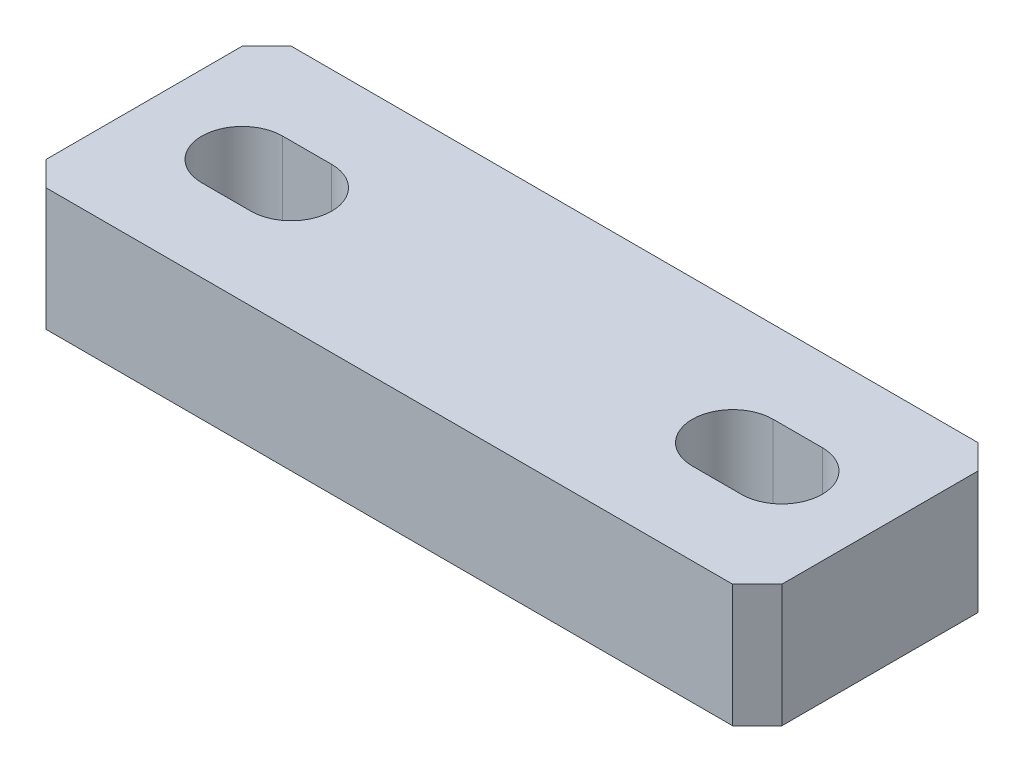
ISO-10303-21;
HEADER;
FILE_DESCRIPTION(('STEP AP214'),'2;1');
FILE_NAME('part.step','',(''),(''),'','','');
FILE_SCHEMA(('AUTOMOTIVE_DESIGN { 1 0 10303 214 1 1 1 1 }'));
ENDSEC;
DATA;
#1=APPLICATION_CONTEXT('core data for automotive mechanical design processes');
#2=APPLICATION_PROTOCOL_DEFINITION('international standard','automotive_design',2000,#1);
#3=PRODUCT_CONTEXT('',#1,'mechanical');
#4=PRODUCT('Part','Part','',(#3));
#5=PRODUCT_RELATED_PRODUCT_CATEGORY('part','',(#4));
#6=PRODUCT_DEFINITION_FORMATION('','',#4);
#7=PRODUCT_DEFINITION_CONTEXT('part definition',#1,'design');
#8=PRODUCT_DEFINITION('design','',#6,#7);
#9=PRODUCT_DEFINITION_SHAPE('','',#8);
#10=(LENGTH_UNIT() NAMED_UNIT(*) SI_UNIT(.MILLI.,.METRE.));
#11=(NAMED_UNIT(*) PLANE_ANGLE_UNIT() SI_UNIT($,.RADIAN.));
#12=(NAMED_UNIT(*) SI_UNIT($,.STERADIAN.) SOLID_ANGLE_UNIT());
#13=UNCERTAINTY_MEASURE_WITH_UNIT(LENGTH_MEASURE(1.E-05),#10,'distance_accuracy_value','');
#14=(GEOMETRIC_REPRESENTATION_CONTEXT(3) GLOBAL_UNCERTAINTY_ASSIGNED_CONTEXT((#13)) GLOBAL_UNIT_ASSIGNED_CONTEXT((#10,
#11,#12)) REPRESENTATION_CONTEXT('',''));
#15=CARTESIAN_POINT('',(0.,0.,0.));
#16=DIRECTION('',(0.,0.,1.));
#17=DIRECTION('',(1.,0.,0.));
#18=AXIS2_PLACEMENT_3D('',#15,#16,#17);
#19=CARTESIAN_POINT('',(-15.,5.,10.));
#20=DIRECTION('',(1.,0.,0.));
#21=DIRECTION('',(0.,0.,-1.));
#22=AXIS2_PLACEMENT_3D('',#19,#20,#21);
#23=PLANE('',#22);
#24=DIRECTION('',(0.,0.,-1.));
#25=VECTOR('',#24,1.);
#26=CARTESIAN_POINT('',(-15.,5.,10.));
#27=LINE('',#26,#25);
#28=CARTESIAN_POINT('',(-15.,5.,9.));
#29=VERTEX_POINT('',#28);
#30=CARTESIAN_POINT('',(-15.,5.,0.999999999999995));
#31=VERTEX_POINT('',#30);
#32=EDGE_CURVE('E228',#29,#31,#27,.T.);
#33=ORIENTED_EDGE('',*,*,#32,.T.);
#34=DIRECTION('',(0.,-1.,0.));
#35=VECTOR('',#34,1.);
#36=CARTESIAN_POINT('',(-15.,5.,0.999999999999994));
#37=LINE('',#36,#35);
#38=CARTESIAN_POINT('',(-15.,0.,0.999999999999995));
#39=VERTEX_POINT('',#38);
#40=EDGE_CURVE('E11',#31,#39,#37,.T.);
#41=ORIENTED_EDGE('',*,*,#40,.T.);
#42=DIRECTION('',(0.,0.,-1.));
#43=VECTOR('',#42,1.);
#44=CARTESIAN_POINT('',(-15.,0.,10.));
#45=LINE('',#44,#43);
#46=CARTESIAN_POINT('',(-15.,0.,9.));
#47=VERTEX_POINT('',#46);
#48=EDGE_CURVE('E240',#47,#39,#45,.T.);
#49=ORIENTED_EDGE('',*,*,#48,.F.);
#50=DIRECTION('',(0.,1.,0.));
#51=VECTOR('',#50,1.);
#52=CARTESIAN_POINT('',(-15.,5.,9.));
#53=LINE('',#52,#51);
#54=EDGE_CURVE('E247',#47,#29,#53,.T.);
#55=ORIENTED_EDGE('',*,*,#54,.T.);
#56=EDGE_LOOP('',(#33,#41,#49,#55));
#57=FACE_BOUND('',#56,.T.);
#58=ADVANCED_FACE('F32',(#57),#23,.F.);
#59=CARTESIAN_POINT('',(-15.,0.,10.));
#60=DIRECTION('',(0.,1.,0.));
#61=DIRECTION('',(0.,0.,1.));
#62=AXIS2_PLACEMENT_3D('',#59,#60,#61);
#63=PLANE('',#62);
#64=DIRECTION('',(1.,0.,0.));
#65=VECTOR('',#64,1.);
#66=CARTESIAN_POINT('',(-15.,0.,6.65));
#67=LINE('',#66,#65);
#68=CARTESIAN_POINT('',(9.,0.,6.65));
#69=VERTEX_POINT('',#68);
#70=CARTESIAN_POINT('',(11.,0.,6.65));
#71=VERTEX_POINT('',#70);
#72=EDGE_CURVE('E183',#69,#71,#67,.T.);
#73=ORIENTED_EDGE('',*,*,#72,.T.);
#74=CARTESIAN_POINT('',(11.,0.,5.));
#75=DIRECTION('',(0.,1.,0.));
#76=DIRECTION('',(0.,0.,1.));
#77=AXIS2_PLACEMENT_3D('',#74,#75,#76);
#78=CIRCLE('',#77,1.65);
#79=CARTESIAN_POINT('',(11.,0.,3.35));
#80=VERTEX_POINT('',#79);
#81=EDGE_CURVE('E186',#71,#80,#78,.T.);
#82=ORIENTED_EDGE('',*,*,#81,.T.);
#83=DIRECTION('',(-1.,0.,0.));
#84=VECTOR('',#83,1.);
#85=CARTESIAN_POINT('',(-15.,0.,3.35));
#86=LINE('',#85,#84);
#87=CARTESIAN_POINT('',(9.,0.,3.35));
#88=VERTEX_POINT('',#87);
#89=EDGE_CURVE('E178',#80,#88,#86,.T.);
#90=ORIENTED_EDGE('',*,*,#89,.T.);
#91=CARTESIAN_POINT('',(9.,0.,5.));
#92=DIRECTION('',(0.,1.,0.));
#93=DIRECTION('',(0.,0.,1.));
#94=AXIS2_PLACEMENT_3D('',#91,#92,#93);
#95=CIRCLE('',#94,1.65);
#96=EDGE_CURVE('E153',#88,#69,#95,.T.);
#97=ORIENTED_EDGE('',*,*,#96,.T.);
#98=EDGE_LOOP('',(#73,#82,#90,#97));
#99=FACE_BOUND('',#98,.T.);
#100=DIRECTION('',(-1.,0.,0.));
#101=VECTOR('',#100,1.);
#102=CARTESIAN_POINT('',(-15.,0.,3.35));
#103=LINE('',#102,#101);
#104=CARTESIAN_POINT('',(-9.,0.,3.35));
#105=VERTEX_POINT('',#104);
#106=CARTESIAN_POINT('',(-11.,0.,3.35));
#107=VERTEX_POINT('',#106);
#108=EDGE_CURVE('E215',#105,#107,#103,.T.);
#109=ORIENTED_EDGE('',*,*,#108,.T.);
#110=CARTESIAN_POINT('',(-11.,0.,5.));
#111=DIRECTION('',(0.,1.,0.));
#112=DIRECTION('',(0.,0.,1.));
#113=AXIS2_PLACEMENT_3D('',#110,#111,#112);
#114=CIRCLE('',#113,1.65);
#115=CARTESIAN_POINT('',(-11.,0.,6.65));
#116=VERTEX_POINT('',#115);
#117=EDGE_CURVE('E218',#107,#116,#114,.T.);
#118=ORIENTED_EDGE('',*,*,#117,.T.);
#119=DIRECTION('',(1.,0.,0.));
#120=VECTOR('',#119,1.);
#121=CARTESIAN_POINT('',(-15.,0.,6.65));
#122=LINE('',#121,#120);
#123=CARTESIAN_POINT('',(-9.,0.,6.65));
#124=VERTEX_POINT('',#123);
#125=EDGE_CURVE('E203',#116,#124,#122,.T.);
#126=ORIENTED_EDGE('',*,*,#125,.T.);
#127=CARTESIAN_POINT('',(-9.,0.,5.));
#128=DIRECTION('',(0.,1.,0.));
#129=DIRECTION('',(0.,0.,1.));
#130=AXIS2_PLACEMENT_3D('',#127,#128,#129);
#131=CIRCLE('',#130,1.65);
#132=EDGE_CURVE('E212',#124,#105,#131,.T.);
#133=ORIENTED_EDGE('',*,*,#132,.T.);
#134=EDGE_LOOP('',(#109,#118,#126,#133));
#135=FACE_BOUND('',#134,.T.);
#136=DIRECTION('',(0.,0.,-1.));
#137=VECTOR('',#136,1.);
#138=CARTESIAN_POINT('',(15.,0.,10.));
#139=LINE('',#138,#137);
#140=CARTESIAN_POINT('',(15.,0.,9.));
#141=VERTEX_POINT('',#140);
#142=CARTESIAN_POINT('',(15.,0.,0.999999999999995));
#143=VERTEX_POINT('',#142);
#144=EDGE_CURVE('E237',#141,#143,#139,.T.);
#145=ORIENTED_EDGE('',*,*,#144,.F.);
#146=DIRECTION('',(-0.707106781186546,0.,0.707106781186549));
#147=VECTOR('',#146,1.);
#148=CARTESIAN_POINT('',(14.,0.,10.));
#149=LINE('',#148,#147);
#150=CARTESIAN_POINT('',(14.,0.,10.));
#151=VERTEX_POINT('',#150);
#152=EDGE_CURVE('E269',#141,#151,#149,.T.);
#153=ORIENTED_EDGE('',*,*,#152,.T.);
#154=DIRECTION('',(1.,0.,0.));
#155=VECTOR('',#154,1.);
#156=CARTESIAN_POINT('',(-15.,0.,10.));
#157=LINE('',#156,#155);
#158=CARTESIAN_POINT('',(-14.,0.,10.));
#159=VERTEX_POINT('',#158);
#160=EDGE_CURVE('E222',#159,#151,#157,.T.);
#161=ORIENTED_EDGE('',*,*,#160,.F.);
#162=DIRECTION('',(-0.707106781186546,0.,-0.707106781186549));
#163=VECTOR('',#162,1.);
#164=CARTESIAN_POINT('',(-14.,0.,10.));
#165=LINE('',#164,#163);
#166=EDGE_CURVE('E245',#159,#47,#165,.T.);
#167=ORIENTED_EDGE('',*,*,#166,.T.);
#168=ORIENTED_EDGE('',*,*,#48,.T.);
#169=DIRECTION('',(-0.707106781186549,0.,0.707106781186546));
#170=VECTOR('',#169,1.);
#171=CARTESIAN_POINT('',(-15.,0.,0.999999999999994));
#172=LINE('',#171,#170);
#173=CARTESIAN_POINT('',(-14.,0.,0.));
#174=VERTEX_POINT('',#173);
#175=EDGE_CURVE('E53',#39,#174,#172,.F.);
#176=ORIENTED_EDGE('',*,*,#175,.T.);
#177=DIRECTION('',(1.,0.,0.));
#178=VECTOR('',#177,1.);
#179=CARTESIAN_POINT('',(-15.,0.,0.));
#180=LINE('',#179,#178);
#181=CARTESIAN_POINT('',(14.,0.,0.));
#182=VERTEX_POINT('',#181);
#183=EDGE_CURVE('E221',#174,#182,#180,.T.);
#184=ORIENTED_EDGE('',*,*,#183,.T.);
#185=DIRECTION('',(-0.707106781186549,0.,-0.707106781186546));
#186=VECTOR('',#185,1.);
#187=CARTESIAN_POINT('',(15.,0.,0.999999999999994));
#188=LINE('',#187,#186);
#189=EDGE_CURVE('E267',#182,#143,#188,.F.);
#190=ORIENTED_EDGE('',*,*,#189,.T.);
#191=EDGE_LOOP('',(#145,#153,#161,#167,#168,#176,#184,#190));
#192=FACE_BOUND('',#191,.T.);
#193=ADVANCED_FACE('F284',(#99,#135,#192),#63,.F.);
#194=CARTESIAN_POINT('',(15.,0.,10.));
#195=DIRECTION('',(-1.,0.,0.));
#196=DIRECTION('',(0.,0.,1.));
#197=AXIS2_PLACEMENT_3D('',#194,#195,#196);
#198=PLANE('',#197);
#199=DIRECTION('',(0.,0.,-1.));
#200=VECTOR('',#199,1.);
#201=CARTESIAN_POINT('',(15.,5.,10.));
#202=LINE('',#201,#200);
#203=CARTESIAN_POINT('',(15.,5.,9.));
#204=VERTEX_POINT('',#203);
#205=CARTESIAN_POINT('',(15.,5.,0.999999999999995));
#206=VERTEX_POINT('',#205);
#207=EDGE_CURVE('E234',#204,#206,#202,.T.);
#208=ORIENTED_EDGE('',*,*,#207,.F.);
#209=DIRECTION('',(0.,-1.,0.));
#210=VECTOR('',#209,1.);
#211=CARTESIAN_POINT('',(15.,0.,9.));
#212=LINE('',#211,#210);
#213=EDGE_CURVE('E264',#204,#141,#212,.T.);
#214=ORIENTED_EDGE('',*,*,#213,.T.);
#215=ORIENTED_EDGE('',*,*,#144,.T.);
#216=DIRECTION('',(0.,1.,0.));
#217=VECTOR('',#216,1.);
#218=CARTESIAN_POINT('',(15.,0.,0.999999999999994));
#219=LINE('',#218,#217);
#220=EDGE_CURVE('E261',#143,#206,#219,.T.);
#221=ORIENTED_EDGE('',*,*,#220,.T.);
#222=EDGE_LOOP('',(#208,#214,#215,#221));
#223=FACE_BOUND('',#222,.T.);
#224=ADVANCED_FACE('F297',(#223),#198,.F.);
#225=CARTESIAN_POINT('',(15.,5.,10.));
#226=DIRECTION('',(0.,-1.,0.));
#227=DIRECTION('',(1.,0.,0.));
#228=AXIS2_PLACEMENT_3D('',#225,#226,#227);
#229=PLANE('',#228);
#230=DIRECTION('',(-1.,0.,0.));
#231=VECTOR('',#230,1.);
#232=CARTESIAN_POINT('',(11.,5.,3.35));
#233=LINE('',#232,#231);
#234=CARTESIAN_POINT('',(11.,5.,3.35));
#235=VERTEX_POINT('',#234);
#236=CARTESIAN_POINT('',(9.,5.,3.35));
#237=VERTEX_POINT('',#236);
#238=EDGE_CURVE('E161',#235,#237,#233,.T.);
#239=ORIENTED_EDGE('',*,*,#238,.F.);
#240=CARTESIAN_POINT('',(11.,5.,5.));
#241=DIRECTION('',(0.,1.,0.));
#242=DIRECTION('',(1.,0.,0.));
#243=AXIS2_PLACEMENT_3D('',#240,#241,#242);
#244=CIRCLE('',#243,1.65);
#245=CARTESIAN_POINT('',(11.,5.,6.65));
#246=VERTEX_POINT('',#245);
#247=EDGE_CURVE('E166',#246,#235,#244,.T.);
#248=ORIENTED_EDGE('',*,*,#247,.F.);
#249=DIRECTION('',(1.,0.,0.));
#250=VECTOR('',#249,1.);
#251=CARTESIAN_POINT('',(11.,5.,6.65));
#252=LINE('',#251,#250);
#253=CARTESIAN_POINT('',(9.,5.,6.65));
#254=VERTEX_POINT('',#253);
#255=EDGE_CURVE('E171',#254,#246,#252,.T.);
#256=ORIENTED_EDGE('',*,*,#255,.F.);
#257=CARTESIAN_POINT('',(9.,5.,5.));
#258=DIRECTION('',(0.,1.,0.));
#259=DIRECTION('',(1.,0.,0.));
#260=AXIS2_PLACEMENT_3D('',#257,#258,#259);
#261=CIRCLE('',#260,1.65);
#262=EDGE_CURVE('E150',#237,#254,#261,.T.);
#263=ORIENTED_EDGE('',*,*,#262,.F.);
#264=EDGE_LOOP('',(#239,#248,#256,#263));
#265=FACE_BOUND('',#264,.T.);
#266=DIRECTION('',(1.,0.,0.));
#267=VECTOR('',#266,1.);
#268=CARTESIAN_POINT('',(-11.,5.,6.65));
#269=LINE('',#268,#267);
#270=CARTESIAN_POINT('',(-11.,5.,6.65));
#271=VERTEX_POINT('',#270);
#272=CARTESIAN_POINT('',(-9.,5.,6.65));
#273=VERTEX_POINT('',#272);
#274=EDGE_CURVE('E191',#271,#273,#269,.T.);
#275=ORIENTED_EDGE('',*,*,#274,.F.);
#276=CARTESIAN_POINT('',(-11.,5.,5.));
#277=DIRECTION('',(0.,1.,0.));
#278=DIRECTION('',(-1.,0.,0.));
#279=AXIS2_PLACEMENT_3D('',#276,#277,#278);
#280=CIRCLE('',#279,1.65);
#281=CARTESIAN_POINT('',(-11.,5.,3.35));
#282=VERTEX_POINT('',#281);
#283=EDGE_CURVE('E189',#282,#271,#280,.T.);
#284=ORIENTED_EDGE('',*,*,#283,.F.);
#285=DIRECTION('',(-1.,0.,0.));
#286=VECTOR('',#285,1.);
#287=CARTESIAN_POINT('',(-11.,5.,3.35));
#288=LINE('',#287,#286);
#289=CARTESIAN_POINT('',(-9.,5.,3.35));
#290=VERTEX_POINT('',#289);
#291=EDGE_CURVE('E197',#290,#282,#288,.T.);
#292=ORIENTED_EDGE('',*,*,#291,.F.);
#293=CARTESIAN_POINT('',(-9.,5.,5.));
#294=DIRECTION('',(0.,1.,0.));
#295=DIRECTION('',(-1.,0.,0.));
#296=AXIS2_PLACEMENT_3D('',#293,#294,#295);
#297=CIRCLE('',#296,1.65);
#298=EDGE_CURVE('E194',#273,#290,#297,.T.);
#299=ORIENTED_EDGE('',*,*,#298,.F.);
#300=EDGE_LOOP('',(#275,#284,#292,#299));
#301=FACE_BOUND('',#300,.T.);
#302=DIRECTION('',(-1.,0.,0.));
#303=VECTOR('',#302,1.);
#304=CARTESIAN_POINT('',(15.,5.,10.));
#305=LINE('',#304,#303);
#306=CARTESIAN_POINT('',(14.,5.,10.));
#307=VERTEX_POINT('',#306);
#308=CARTESIAN_POINT('',(-14.,5.,10.));
#309=VERTEX_POINT('',#308);
#310=EDGE_CURVE('E225',#307,#309,#305,.T.);
#311=ORIENTED_EDGE('',*,*,#310,.F.);
#312=DIRECTION('',(0.707106781186546,0.,-0.707106781186549));
#313=VECTOR('',#312,1.);
#314=CARTESIAN_POINT('',(14.,5.,10.));
#315=LINE('',#314,#313);
#316=EDGE_CURVE('E259',#307,#204,#315,.T.);
#317=ORIENTED_EDGE('',*,*,#316,.T.);
#318=ORIENTED_EDGE('',*,*,#207,.T.);
#319=DIRECTION('',(0.707106781186549,0.,0.707106781186546));
#320=VECTOR('',#319,1.);
#321=CARTESIAN_POINT('',(15.,5.,0.999999999999994));
#322=LINE('',#321,#320);
#323=CARTESIAN_POINT('',(14.,5.,0.));
#324=VERTEX_POINT('',#323);
#325=EDGE_CURVE('E257',#206,#324,#322,.F.);
#326=ORIENTED_EDGE('',*,*,#325,.T.);
#327=DIRECTION('',(-1.,0.,0.));
#328=VECTOR('',#327,1.);
#329=CARTESIAN_POINT('',(15.,5.,0.));
#330=LINE('',#329,#328);
#331=CARTESIAN_POINT('',(-14.,5.,0.));
#332=VERTEX_POINT('',#331);
#333=EDGE_CURVE('E226',#324,#332,#330,.T.);
#334=ORIENTED_EDGE('',*,*,#333,.T.);
#335=DIRECTION('',(0.707106781186549,0.,-0.707106781186546));
#336=VECTOR('',#335,1.);
#337=CARTESIAN_POINT('',(-15.,5.,0.999999999999994));
#338=LINE('',#337,#336);
#339=EDGE_CURVE('E255',#332,#31,#338,.F.);
#340=ORIENTED_EDGE('',*,*,#339,.T.);
#341=ORIENTED_EDGE('',*,*,#32,.F.);
#342=DIRECTION('',(0.707106781186546,0.,0.707106781186549));
#343=VECTOR('',#342,1.);
#344=CARTESIAN_POINT('',(-14.,5.,10.));
#345=LINE('',#344,#343);
#346=EDGE_CURVE('E249',#29,#309,#345,.T.);
#347=ORIENTED_EDGE('',*,*,#346,.T.);
#348=EDGE_LOOP('',(#311,#317,#318,#326,#334,#340,#341,#347));
#349=FACE_BOUND('',#348,.T.);
#350=ADVANCED_FACE('F168',(#265,#301,#349),#229,.F.);
#351=CARTESIAN_POINT('',(0.,0.,10.));
#352=DIRECTION('',(0.,0.,1.));
#353=DIRECTION('',(1.,0.,0.));
#354=AXIS2_PLACEMENT_3D('',#351,#352,#353);
#355=PLANE('',#354);
#356=ORIENTED_EDGE('',*,*,#160,.T.);
#357=DIRECTION('',(0.,1.,0.));
#358=VECTOR('',#357,1.);
#359=CARTESIAN_POINT('',(14.,5.,10.));
#360=LINE('',#359,#358);
#361=EDGE_CURVE('E252',#151,#307,#360,.T.);
#362=ORIENTED_EDGE('',*,*,#361,.T.);
#363=ORIENTED_EDGE('',*,*,#310,.T.);
#364=DIRECTION('',(0.,-1.,0.));
#365=VECTOR('',#364,1.);
#366=CARTESIAN_POINT('',(-14.,0.,10.));
#367=LINE('',#366,#365);
#368=EDGE_CURVE('E242',#309,#159,#367,.T.);
#369=ORIENTED_EDGE('',*,*,#368,.T.);
#370=EDGE_LOOP('',(#356,#362,#363,#369));
#371=FACE_BOUND('',#370,.T.);
#372=ADVANCED_FACE('F291',(#371),#355,.T.);
#373=CARTESIAN_POINT('',(0.,0.,0.));
#374=DIRECTION('',(0.,0.,1.));
#375=DIRECTION('',(1.,0.,0.));
#376=AXIS2_PLACEMENT_3D('',#373,#374,#375);
#377=PLANE('',#376);
#378=ORIENTED_EDGE('',*,*,#333,.F.);
#379=DIRECTION('',(0.,-1.,0.));
#380=VECTOR('',#379,1.);
#381=CARTESIAN_POINT('',(14.,0.,0.));
#382=LINE('',#381,#380);
#383=EDGE_CURVE('E40',#324,#182,#382,.T.);
#384=ORIENTED_EDGE('',*,*,#383,.T.);
#385=ORIENTED_EDGE('',*,*,#183,.F.);
#386=DIRECTION('',(0.,1.,0.));
#387=VECTOR('',#386,1.);
#388=CARTESIAN_POINT('',(-14.,0.,0.));
#389=LINE('',#388,#387);
#390=EDGE_CURVE('E271',#174,#332,#389,.T.);
#391=ORIENTED_EDGE('',*,*,#390,.T.);
#392=EDGE_LOOP('',(#378,#384,#385,#391));
#393=FACE_BOUND('',#392,.T.);
#394=ADVANCED_FACE('F273',(#393),#377,.F.);
#395=CARTESIAN_POINT('',(-11.,-5.,5.));
#396=DIRECTION('',(0.,1.,0.));
#397=DIRECTION('',(-1.,0.,0.));
#398=AXIS2_PLACEMENT_3D('',#395,#396,#397);
#399=CYLINDRICAL_SURFACE('',#398,1.65);
#400=DIRECTION('',(0.,1.,0.));
#401=VECTOR('',#400,1.);
#402=CARTESIAN_POINT('',(-11.,-5.,3.35));
#403=LINE('',#402,#401);
#404=EDGE_CURVE('E201',#107,#282,#403,.T.);
#405=ORIENTED_EDGE('',*,*,#404,.T.);
#406=ORIENTED_EDGE('',*,*,#283,.T.);
#407=DIRECTION('',(0.,1.,0.));
#408=VECTOR('',#407,1.);
#409=CARTESIAN_POINT('',(-11.,-5.,6.65));
#410=LINE('',#409,#408);
#411=EDGE_CURVE('E200',#116,#271,#410,.T.);
#412=ORIENTED_EDGE('',*,*,#411,.F.);
#413=ORIENTED_EDGE('',*,*,#117,.F.);
#414=EDGE_LOOP('',(#405,#406,#412,#413));
#415=FACE_BOUND('',#414,.T.);
#416=ADVANCED_FACE('F340',(#415),#399,.F.);
#417=CARTESIAN_POINT('',(-11.,-5.,3.35));
#418=DIRECTION('',(0.,0.,-1.));
#419=DIRECTION('',(-1.,0.,0.));
#420=AXIS2_PLACEMENT_3D('',#417,#418,#419);
#421=PLANE('',#420);
#422=DIRECTION('',(0.,1.,0.));
#423=VECTOR('',#422,1.);
#424=CARTESIAN_POINT('',(-9.,-5.,3.35));
#425=LINE('',#424,#423);
#426=EDGE_CURVE('E204',#105,#290,#425,.T.);
#427=ORIENTED_EDGE('',*,*,#426,.T.);
#428=ORIENTED_EDGE('',*,*,#291,.T.);
#429=ORIENTED_EDGE('',*,*,#404,.F.);
#430=ORIENTED_EDGE('',*,*,#108,.F.);
#431=EDGE_LOOP('',(#427,#428,#429,#430));
#432=FACE_BOUND('',#431,.T.);
#433=ADVANCED_FACE('F336',(#432),#421,.F.);
#434=CARTESIAN_POINT('',(-9.,-5.,5.));
#435=DIRECTION('',(0.,1.,0.));
#436=DIRECTION('',(-1.,0.,0.));
#437=AXIS2_PLACEMENT_3D('',#434,#435,#436);
#438=CYLINDRICAL_SURFACE('',#437,1.65);
#439=DIRECTION('',(0.,1.,0.));
#440=VECTOR('',#439,1.);
#441=CARTESIAN_POINT('',(-9.,-5.,6.65));
#442=LINE('',#441,#440);
#443=EDGE_CURVE('E206',#124,#273,#442,.T.);
#444=ORIENTED_EDGE('',*,*,#443,.T.);
#445=ORIENTED_EDGE('',*,*,#298,.T.);
#446=ORIENTED_EDGE('',*,*,#426,.F.);
#447=ORIENTED_EDGE('',*,*,#132,.F.);
#448=EDGE_LOOP('',(#444,#445,#446,#447));
#449=FACE_BOUND('',#448,.T.);
#450=ADVANCED_FACE('F339',(#449),#438,.F.);
#451=CARTESIAN_POINT('',(-11.,-5.,6.65));
#452=DIRECTION('',(0.,0.,1.));
#453=DIRECTION('',(1.,0.,0.));
#454=AXIS2_PLACEMENT_3D('',#451,#452,#453);
#455=PLANE('',#454);
#456=ORIENTED_EDGE('',*,*,#411,.T.);
#457=ORIENTED_EDGE('',*,*,#274,.T.);
#458=ORIENTED_EDGE('',*,*,#443,.F.);
#459=ORIENTED_EDGE('',*,*,#125,.F.);
#460=EDGE_LOOP('',(#456,#457,#458,#459));
#461=FACE_BOUND('',#460,.T.);
#462=ADVANCED_FACE('F334',(#461),#455,.F.);
#463=CARTESIAN_POINT('',(11.,-5.,5.));
#464=DIRECTION('',(0.,1.,0.));
#465=DIRECTION('',(-1.,0.,0.));
#466=AXIS2_PLACEMENT_3D('',#463,#464,#465);
#467=CYLINDRICAL_SURFACE('',#466,1.65);
#468=DIRECTION('',(0.,1.,0.));
#469=VECTOR('',#468,1.);
#470=CARTESIAN_POINT('',(11.,-5.,6.65));
#471=LINE('',#470,#469);
#472=EDGE_CURVE('E176',#71,#246,#471,.T.);
#473=ORIENTED_EDGE('',*,*,#472,.T.);
#474=ORIENTED_EDGE('',*,*,#247,.T.);
#475=DIRECTION('',(0.,1.,0.));
#476=VECTOR('',#475,1.);
#477=CARTESIAN_POINT('',(11.,-5.,3.35));
#478=LINE('',#477,#476);
#479=EDGE_CURVE('E157',#80,#235,#478,.T.);
#480=ORIENTED_EDGE('',*,*,#479,.F.);
#481=ORIENTED_EDGE('',*,*,#81,.F.);
#482=EDGE_LOOP('',(#473,#474,#480,#481));
#483=FACE_BOUND('',#482,.T.);
#484=ADVANCED_FACE('F331',(#483),#467,.F.);
#485=CARTESIAN_POINT('',(11.,-5.,6.65));
#486=DIRECTION('',(0.,0.,1.));
#487=DIRECTION('',(1.,0.,0.));
#488=AXIS2_PLACEMENT_3D('',#485,#486,#487);
#489=PLANE('',#488);
#490=DIRECTION('',(0.,1.,0.));
#491=VECTOR('',#490,1.);
#492=CARTESIAN_POINT('',(9.,-5.,6.65));
#493=LINE('',#492,#491);
#494=EDGE_CURVE('E156',#69,#254,#493,.T.);
#495=ORIENTED_EDGE('',*,*,#494,.T.);
#496=ORIENTED_EDGE('',*,*,#255,.T.);
#497=ORIENTED_EDGE('',*,*,#472,.F.);
#498=ORIENTED_EDGE('',*,*,#72,.F.);
#499=EDGE_LOOP('',(#495,#496,#497,#498));
#500=FACE_BOUND('',#499,.T.);
#501=ADVANCED_FACE('F327',(#500),#489,.F.);
#502=CARTESIAN_POINT('',(9.,-5.,5.));
#503=DIRECTION('',(0.,1.,0.));
#504=DIRECTION('',(-1.,0.,0.));
#505=AXIS2_PLACEMENT_3D('',#502,#503,#504);
#506=CYLINDRICAL_SURFACE('',#505,1.65);
#507=DIRECTION('',(0.,1.,0.));
#508=VECTOR('',#507,1.);
#509=CARTESIAN_POINT('',(9.,-5.,3.35));
#510=LINE('',#509,#508);
#511=EDGE_CURVE('E145',#88,#237,#510,.T.);
#512=ORIENTED_EDGE('',*,*,#511,.T.);
#513=ORIENTED_EDGE('',*,*,#262,.T.);
#514=ORIENTED_EDGE('',*,*,#494,.F.);
#515=ORIENTED_EDGE('',*,*,#96,.F.);
#516=EDGE_LOOP('',(#512,#513,#514,#515));
#517=FACE_BOUND('',#516,.T.);
#518=ADVANCED_FACE('F147',(#517),#506,.F.);
#519=CARTESIAN_POINT('',(11.,-5.,3.35));
#520=DIRECTION('',(0.,0.,-1.));
#521=DIRECTION('',(-1.,0.,0.));
#522=AXIS2_PLACEMENT_3D('',#519,#520,#521);
#523=PLANE('',#522);
#524=ORIENTED_EDGE('',*,*,#479,.T.);
#525=ORIENTED_EDGE('',*,*,#238,.T.);
#526=ORIENTED_EDGE('',*,*,#511,.F.);
#527=ORIENTED_EDGE('',*,*,#89,.F.);
#528=EDGE_LOOP('',(#524,#525,#526,#527));
#529=FACE_BOUND('',#528,.T.);
#530=ADVANCED_FACE('F162',(#529),#523,.F.);
#531=CARTESIAN_POINT('',(-14.,0.,10.));
#532=DIRECTION('',(-0.707106781186549,0.,0.707106781186546));
#533=DIRECTION('',(0.,1.,0.));
#534=AXIS2_PLACEMENT_3D('',#531,#532,#533);
#535=PLANE('',#534);
#536=ORIENTED_EDGE('',*,*,#346,.F.);
#537=ORIENTED_EDGE('',*,*,#54,.F.);
#538=ORIENTED_EDGE('',*,*,#166,.F.);
#539=ORIENTED_EDGE('',*,*,#368,.F.);
#540=EDGE_LOOP('',(#536,#537,#538,#539));
#541=FACE_BOUND('',#540,.T.);
#542=ADVANCED_FACE('F289',(#541),#535,.T.);
#543=CARTESIAN_POINT('',(14.,0.,10.));
#544=DIRECTION('',(0.707106781186549,0.,0.707106781186546));
#545=DIRECTION('',(0.,-1.,0.));
#546=AXIS2_PLACEMENT_3D('',#543,#544,#545);
#547=PLANE('',#546);
#548=ORIENTED_EDGE('',*,*,#152,.F.);
#549=ORIENTED_EDGE('',*,*,#213,.F.);
#550=ORIENTED_EDGE('',*,*,#316,.F.);
#551=ORIENTED_EDGE('',*,*,#361,.F.);
#552=EDGE_LOOP('',(#548,#549,#550,#551));
#553=FACE_BOUND('',#552,.T.);
#554=ADVANCED_FACE('F300',(#553),#547,.T.);
#555=CARTESIAN_POINT('',(15.,0.,0.999999999999994));
#556=DIRECTION('',(-0.707106781186546,0.,0.707106781186549));
#557=DIRECTION('',(0.,1.,0.));
#558=AXIS2_PLACEMENT_3D('',#555,#556,#557);
#559=PLANE('',#558);
#560=ORIENTED_EDGE('',*,*,#189,.F.);
#561=ORIENTED_EDGE('',*,*,#383,.F.);
#562=ORIENTED_EDGE('',*,*,#325,.F.);
#563=ORIENTED_EDGE('',*,*,#220,.F.);
#564=EDGE_LOOP('',(#560,#561,#562,#563));
#565=FACE_BOUND('',#564,.T.);
#566=ADVANCED_FACE('F303',(#565),#559,.F.);
#567=CARTESIAN_POINT('',(-15.,5.,0.999999999999994));
#568=DIRECTION('',(0.707106781186546,0.,0.707106781186549));
#569=DIRECTION('',(0.,-1.,0.));
#570=AXIS2_PLACEMENT_3D('',#567,#568,#569);
#571=PLANE('',#570);
#572=ORIENTED_EDGE('',*,*,#339,.F.);
#573=ORIENTED_EDGE('',*,*,#390,.F.);
#574=ORIENTED_EDGE('',*,*,#175,.F.);
#575=ORIENTED_EDGE('',*,*,#40,.F.);
#576=EDGE_LOOP('',(#572,#573,#574,#575));
#577=FACE_BOUND('',#576,.T.);
#578=ADVANCED_FACE('F34',(#577),#571,.F.);
#579=CLOSED_SHELL('',(#58,#193,#224,#350,#372,#394,#416,#433,#450,#462,#484,#501,#518,#530,#542,
#554,#566,#578));
#580=MANIFOLD_SOLID_BREP('B2',#579);
#581=ADVANCED_BREP_SHAPE_REPRESENTATION('',(#18,#580),#14);
#582=SHAPE_DEFINITION_REPRESENTATION(#9,#581);
ENDSEC;
END-ISO-10303-21;
